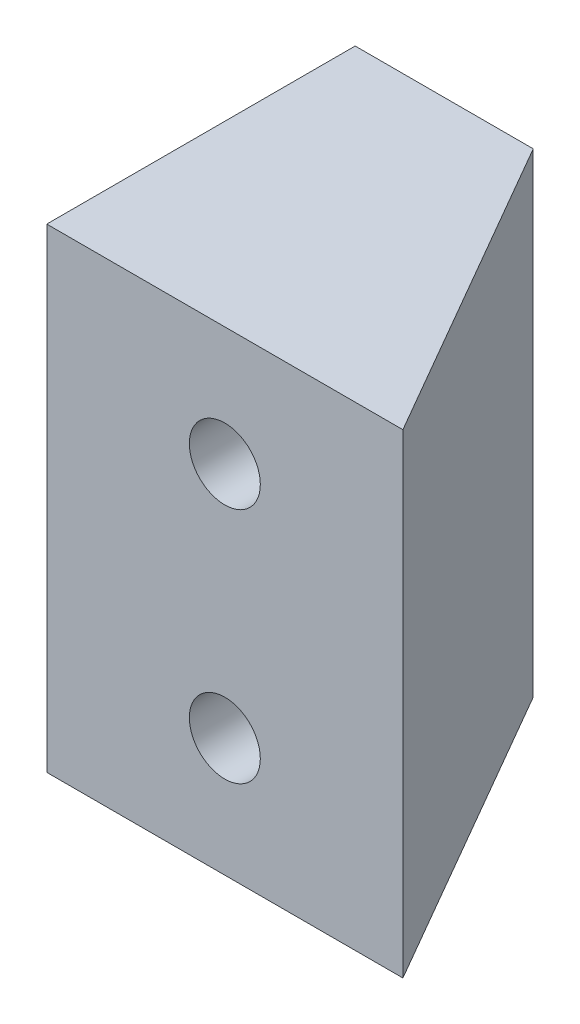
ISO-10303-21;
HEADER;
FILE_DESCRIPTION(('STEP AP214'),'2;1');
FILE_NAME('part.step','',(''),(''),'','','');
FILE_SCHEMA(('AUTOMOTIVE_DESIGN { 1 0 10303 214 1 1 1 1 }'));
ENDSEC;
DATA;
#1=APPLICATION_CONTEXT('core data for automotive mechanical design processes');
#2=APPLICATION_PROTOCOL_DEFINITION('international standard','automotive_design',2000,#1);
#3=PRODUCT_CONTEXT('',#1,'mechanical');
#4=PRODUCT('Part','Part','',(#3));
#5=PRODUCT_RELATED_PRODUCT_CATEGORY('part','',(#4));
#6=PRODUCT_DEFINITION_FORMATION('','',#4);
#7=PRODUCT_DEFINITION_CONTEXT('part definition',#1,'design');
#8=PRODUCT_DEFINITION('design','',#6,#7);
#9=PRODUCT_DEFINITION_SHAPE('','',#8);
#10=(LENGTH_UNIT() NAMED_UNIT(*) SI_UNIT(.MILLI.,.METRE.));
#11=(NAMED_UNIT(*) PLANE_ANGLE_UNIT() SI_UNIT($,.RADIAN.));
#12=(NAMED_UNIT(*) SI_UNIT($,.STERADIAN.) SOLID_ANGLE_UNIT());
#13=UNCERTAINTY_MEASURE_WITH_UNIT(LENGTH_MEASURE(1.E-05),#10,'distance_accuracy_value','');
#14=(GEOMETRIC_REPRESENTATION_CONTEXT(3) GLOBAL_UNCERTAINTY_ASSIGNED_CONTEXT((#13)) GLOBAL_UNIT_ASSIGNED_CONTEXT((#10,
#11,#12)) REPRESENTATION_CONTEXT('',''));
#15=CARTESIAN_POINT('',(0.,0.,0.));
#16=DIRECTION('',(0.,0.,1.));
#17=DIRECTION('',(1.,0.,0.));
#18=AXIS2_PLACEMENT_3D('',#15,#16,#17);
#19=CARTESIAN_POINT('',(0.,25.4,-10.9985226280624));
#20=DIRECTION('',(0.,0.,-1.));
#21=DIRECTION('',(-1.,0.,0.));
#22=AXIS2_PLACEMENT_3D('',#19,#20,#21);
#23=PLANE('',#22);
#24=DIRECTION('',(1.,0.,0.));
#25=VECTOR('',#24,1.);
#26=CARTESIAN_POINT('',(0.,0.,-10.9985226280624));
#27=LINE('',#26,#25);
#28=CARTESIAN_POINT('',(-9.525,0.,-10.9985226280624));
#29=VERTEX_POINT('',#28);
#30=CARTESIAN_POINT('',(0.,0.,-10.9985226280624));
#31=VERTEX_POINT('',#30);
#32=EDGE_CURVE('E105',#29,#31,#27,.T.);
#33=ORIENTED_EDGE('',*,*,#32,.F.);
#34=DIRECTION('',(0.,-1.,0.));
#35=VECTOR('',#34,1.);
#36=CARTESIAN_POINT('',(-9.525,25.4,-10.9985226280624));
#37=LINE('',#36,#35);
#38=CARTESIAN_POINT('',(-9.525,25.4,-10.9985226280624));
#39=VERTEX_POINT('',#38);
#40=EDGE_CURVE('E11',#39,#29,#37,.T.);
#41=ORIENTED_EDGE('',*,*,#40,.F.);
#42=DIRECTION('',(1.,0.,0.));
#43=VECTOR('',#42,1.);
#44=CARTESIAN_POINT('',(0.,25.4,-10.9985226280624));
#45=LINE('',#44,#43);
#46=CARTESIAN_POINT('',(0.,25.4,-10.9985226280624));
#47=VERTEX_POINT('',#46);
#48=EDGE_CURVE('E106',#39,#47,#45,.T.);
#49=ORIENTED_EDGE('',*,*,#48,.T.);
#50=DIRECTION('',(0.,-1.,0.));
#51=VECTOR('',#50,1.);
#52=CARTESIAN_POINT('',(0.,25.4,-10.9985226280624));
#53=LINE('',#52,#51);
#54=EDGE_CURVE('E73',#47,#31,#53,.T.);
#55=ORIENTED_EDGE('',*,*,#54,.T.);
#56=EDGE_LOOP('',(#33,#41,#49,#55));
#57=FACE_BOUND('',#56,.T.);
#58=ADVANCED_FACE('F34',(#57),#23,.T.);
#59=CARTESIAN_POINT('',(-9.525,25.4,0.));
#60=DIRECTION('',(-1.,0.,0.));
#61=DIRECTION('',(0.,0.,1.));
#62=AXIS2_PLACEMENT_3D('',#59,#60,#61);
#63=PLANE('',#62);
#64=DIRECTION('',(0.,0.,-1.));
#65=VECTOR('',#64,1.);
#66=CARTESIAN_POINT('',(-9.525,0.,0.));
#67=LINE('',#66,#65);
#68=CARTESIAN_POINT('',(-9.525,0.,5.49926131403118));
#69=VERTEX_POINT('',#68);
#70=EDGE_CURVE('E117',#69,#29,#67,.T.);
#71=ORIENTED_EDGE('',*,*,#70,.F.);
#72=DIRECTION('',(0.,-1.,0.));
#73=VECTOR('',#72,1.);
#74=CARTESIAN_POINT('',(-9.525,25.4,5.49926131403118));
#75=LINE('',#74,#73);
#76=CARTESIAN_POINT('',(-9.525,25.4,5.49926131403118));
#77=VERTEX_POINT('',#76);
#78=EDGE_CURVE('E42',#77,#69,#75,.T.);
#79=ORIENTED_EDGE('',*,*,#78,.F.);
#80=DIRECTION('',(0.,0.,-1.));
#81=VECTOR('',#80,1.);
#82=CARTESIAN_POINT('',(-9.525,25.4,0.));
#83=LINE('',#82,#81);
#84=EDGE_CURVE('E108',#77,#39,#83,.T.);
#85=ORIENTED_EDGE('',*,*,#84,.T.);
#86=ORIENTED_EDGE('',*,*,#40,.T.);
#87=EDGE_LOOP('',(#71,#79,#85,#86));
#88=FACE_BOUND('',#87,.T.);
#89=ADVANCED_FACE('F132',(#88),#63,.T.);
#90=CARTESIAN_POINT('',(0.,25.4,5.49926131403118));
#91=DIRECTION('',(0.,0.,-1.));
#92=DIRECTION('',(-1.,0.,0.));
#93=AXIS2_PLACEMENT_3D('',#90,#91,#92);
#94=PLANE('',#93);
#95=CARTESIAN_POINT('',(0.,19.05,5.49926131403119));
#96=DIRECTION('',(0.,0.,1.));
#97=DIRECTION('',(1.,0.,0.));
#98=AXIS2_PLACEMENT_3D('',#95,#96,#97);
#99=CIRCLE('',#98,1.89864999999999);
#100=CARTESIAN_POINT('',(1.89864999999999,19.05,5.49926131403119));
#101=VERTEX_POINT('',#100);
#102=EDGE_CURVE('E95',#101,#101,#99,.T.);
#103=ORIENTED_EDGE('',*,*,#102,.F.);
#104=EDGE_LOOP('',(#103));
#105=FACE_BOUND('',#104,.T.);
#106=CARTESIAN_POINT('',(0.,6.35,5.49926131403119));
#107=DIRECTION('',(0.,0.,1.));
#108=DIRECTION('',(1.,0.,0.));
#109=AXIS2_PLACEMENT_3D('',#106,#107,#108);
#110=CIRCLE('',#109,1.89864999999999);
#111=CARTESIAN_POINT('',(1.89864999999999,6.35,5.49926131403119));
#112=VERTEX_POINT('',#111);
#113=EDGE_CURVE('E94',#112,#112,#110,.T.);
#114=ORIENTED_EDGE('',*,*,#113,.F.);
#115=EDGE_LOOP('',(#114));
#116=FACE_BOUND('',#115,.T.);
#117=DIRECTION('',(1.,0.,0.));
#118=VECTOR('',#117,1.);
#119=CARTESIAN_POINT('',(0.,0.,5.49926131403118));
#120=LINE('',#119,#118);
#121=CARTESIAN_POINT('',(9.525,0.,5.49926131403119));
#122=VERTEX_POINT('',#121);
#123=EDGE_CURVE('E66',#69,#122,#120,.T.);
#124=ORIENTED_EDGE('',*,*,#123,.T.);
#125=DIRECTION('',(0.,-1.,0.));
#126=VECTOR('',#125,1.);
#127=CARTESIAN_POINT('',(9.525,25.4,5.49926131403119));
#128=LINE('',#127,#126);
#129=CARTESIAN_POINT('',(9.525,25.4,5.49926131403119));
#130=VERTEX_POINT('',#129);
#131=EDGE_CURVE('E123',#130,#122,#128,.T.);
#132=ORIENTED_EDGE('',*,*,#131,.F.);
#133=DIRECTION('',(1.,0.,0.));
#134=VECTOR('',#133,1.);
#135=CARTESIAN_POINT('',(0.,25.4,5.49926131403118));
#136=LINE('',#135,#134);
#137=EDGE_CURVE('E112',#77,#130,#136,.T.);
#138=ORIENTED_EDGE('',*,*,#137,.F.);
#139=ORIENTED_EDGE('',*,*,#78,.T.);
#140=EDGE_LOOP('',(#124,#132,#138,#139));
#141=FACE_BOUND('',#140,.T.);
#142=ADVANCED_FACE('F125',(#105,#116,#141),#94,.F.);
#143=CARTESIAN_POINT('',(4.76249999999999,25.4,-2.74963065701559));
#144=DIRECTION('',(-0.866025403784438,0.,0.5));
#145=DIRECTION('',(0.500000000000001,0.,0.866025403784438));
#146=AXIS2_PLACEMENT_3D('',#143,#144,#145);
#147=PLANE('',#146);
#148=DIRECTION('',(-0.5,0.,-0.866025403784438));
#149=VECTOR('',#148,1.);
#150=CARTESIAN_POINT('',(4.76249999999999,0.,-2.74963065701559));
#151=LINE('',#150,#149);
#152=EDGE_CURVE('E109',#122,#31,#151,.T.);
#153=ORIENTED_EDGE('',*,*,#152,.T.);
#154=ORIENTED_EDGE('',*,*,#54,.F.);
#155=DIRECTION('',(-0.5,0.,-0.866025403784438));
#156=VECTOR('',#155,1.);
#157=CARTESIAN_POINT('',(4.76249999999999,25.4,-2.74963065701559));
#158=LINE('',#157,#156);
#159=EDGE_CURVE('E50',#130,#47,#158,.T.);
#160=ORIENTED_EDGE('',*,*,#159,.F.);
#161=ORIENTED_EDGE('',*,*,#131,.T.);
#162=EDGE_LOOP('',(#153,#154,#160,#161));
#163=FACE_BOUND('',#162,.T.);
#164=ADVANCED_FACE('F140',(#163),#147,.F.);
#165=CARTESIAN_POINT('',(0.,25.4,0.));
#166=DIRECTION('',(0.,1.,0.));
#167=DIRECTION('',(0.,0.,1.));
#168=AXIS2_PLACEMENT_3D('',#165,#166,#167);
#169=PLANE('',#168);
#170=ORIENTED_EDGE('',*,*,#48,.F.);
#171=ORIENTED_EDGE('',*,*,#84,.F.);
#172=ORIENTED_EDGE('',*,*,#137,.T.);
#173=ORIENTED_EDGE('',*,*,#159,.T.);
#174=EDGE_LOOP('',(#170,#171,#172,#173));
#175=FACE_BOUND('',#174,.T.);
#176=ADVANCED_FACE('F146',(#175),#169,.T.);
#177=CARTESIAN_POINT('',(0.,0.,0.));
#178=DIRECTION('',(0.,1.,0.));
#179=DIRECTION('',(0.,0.,1.));
#180=AXIS2_PLACEMENT_3D('',#177,#178,#179);
#181=PLANE('',#180);
#182=ORIENTED_EDGE('',*,*,#32,.T.);
#183=ORIENTED_EDGE('',*,*,#152,.F.);
#184=ORIENTED_EDGE('',*,*,#123,.F.);
#185=ORIENTED_EDGE('',*,*,#70,.T.);
#186=EDGE_LOOP('',(#182,#183,#184,#185));
#187=FACE_BOUND('',#186,.T.);
#188=ADVANCED_FACE('F131',(#187),#181,.F.);
#189=CARTESIAN_POINT('',(0.,6.35,-7.20073868596882));
#190=DIRECTION('',(0.,0.,1.));
#191=DIRECTION('',(1.,0.,0.));
#192=AXIS2_PLACEMENT_3D('',#189,#190,#191);
#193=CONICAL_SURFACE('',#192,1.89864999999999,1.02974425867665);
#194=CARTESIAN_POINT('',(0.,6.35,-8.34156270028549));
#195=VERTEX_POINT('',#194);
#196=VERTEX_LOOP('',#195);
#197=FACE_BOUND('',#196,.T.);
#198=CARTESIAN_POINT('',(0.,6.35,-7.20073868596882));
#199=DIRECTION('',(0.,0.,1.));
#200=DIRECTION('',(1.,0.,0.));
#201=AXIS2_PLACEMENT_3D('',#198,#199,#200);
#202=CIRCLE('',#201,1.89864999999999);
#203=CARTESIAN_POINT('',(1.89864999999998,6.35,-7.20073868596882));
#204=VERTEX_POINT('',#203);
#205=EDGE_CURVE('E98',#204,#204,#202,.T.);
#206=ORIENTED_EDGE('',*,*,#205,.T.);
#207=EDGE_LOOP('',(#206));
#208=FACE_BOUND('',#207,.T.);
#209=ADVANCED_FACE('F150',(#197,#208),#193,.F.);
#210=CARTESIAN_POINT('',(0.,6.35,5.49926131403118));
#211=DIRECTION('',(0.,0.,1.));
#212=DIRECTION('',(1.,0.,0.));
#213=AXIS2_PLACEMENT_3D('',#210,#211,#212);
#214=CYLINDRICAL_SURFACE('',#213,1.89864999999999);
#215=ORIENTED_EDGE('',*,*,#205,.F.);
#216=EDGE_LOOP('',(#215));
#217=FACE_BOUND('',#216,.T.);
#218=ORIENTED_EDGE('',*,*,#113,.T.);
#219=EDGE_LOOP('',(#218));
#220=FACE_BOUND('',#219,.T.);
#221=ADVANCED_FACE('F88',(#217,#220),#214,.F.);
#222=CARTESIAN_POINT('',(0.,19.05,-7.20073868596882));
#223=DIRECTION('',(0.,0.,1.));
#224=DIRECTION('',(1.,0.,0.));
#225=AXIS2_PLACEMENT_3D('',#222,#223,#224);
#226=CONICAL_SURFACE('',#225,1.89864999999999,1.02974425867665);
#227=CARTESIAN_POINT('',(0.,19.05,-8.34156270028549));
#228=VERTEX_POINT('',#227);
#229=VERTEX_LOOP('',#228);
#230=FACE_BOUND('',#229,.T.);
#231=CARTESIAN_POINT('',(0.,19.05,-7.20073868596882));
#232=DIRECTION('',(0.,0.,1.));
#233=DIRECTION('',(1.,0.,0.));
#234=AXIS2_PLACEMENT_3D('',#231,#232,#233);
#235=CIRCLE('',#234,1.89864999999999);
#236=CARTESIAN_POINT('',(1.89864999999998,19.05,-7.20073868596882));
#237=VERTEX_POINT('',#236);
#238=EDGE_CURVE('E92',#237,#237,#235,.T.);
#239=ORIENTED_EDGE('',*,*,#238,.T.);
#240=EDGE_LOOP('',(#239));
#241=FACE_BOUND('',#240,.T.);
#242=ADVANCED_FACE('F84',(#230,#241),#226,.F.);
#243=CARTESIAN_POINT('',(0.,19.05,5.49926131403118));
#244=DIRECTION('',(0.,0.,1.));
#245=DIRECTION('',(1.,0.,0.));
#246=AXIS2_PLACEMENT_3D('',#243,#244,#245);
#247=CYLINDRICAL_SURFACE('',#246,1.89864999999999);
#248=ORIENTED_EDGE('',*,*,#238,.F.);
#249=EDGE_LOOP('',(#248));
#250=FACE_BOUND('',#249,.T.);
#251=ORIENTED_EDGE('',*,*,#102,.T.);
#252=EDGE_LOOP('',(#251));
#253=FACE_BOUND('',#252,.T.);
#254=ADVANCED_FACE('F87',(#250,#253),#247,.F.);
#255=CLOSED_SHELL('',(#58,#89,#142,#164,#176,#188,#209,#221,#242,#254));
#256=MANIFOLD_SOLID_BREP('B2',#255);
#257=ADVANCED_BREP_SHAPE_REPRESENTATION('',(#18,#256),#14);
#258=SHAPE_DEFINITION_REPRESENTATION(#9,#257);
ENDSEC;
END-ISO-10303-21;
